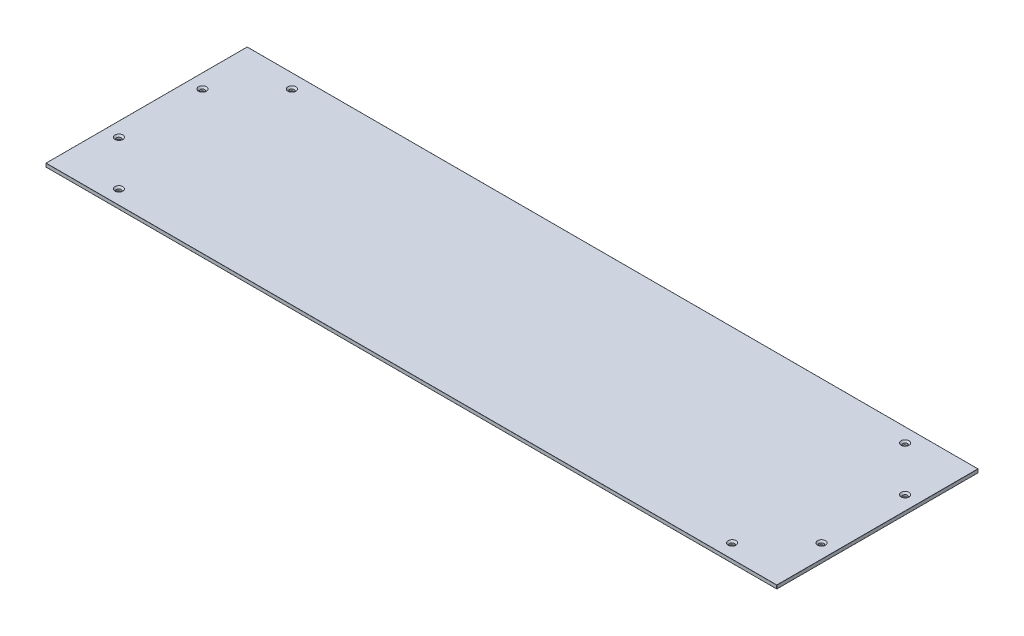
ISO-10303-21;
HEADER;
FILE_DESCRIPTION(('STEP AP214'),'2;1');
FILE_NAME('part.step','',(''),(''),'','','');
FILE_SCHEMA(('AUTOMOTIVE_DESIGN { 1 0 10303 214 1 1 1 1 }'));
ENDSEC;
DATA;
#1=APPLICATION_CONTEXT('core data for automotive mechanical design processes');
#2=APPLICATION_PROTOCOL_DEFINITION('international standard','automotive_design',2000,#1);
#3=PRODUCT_CONTEXT('',#1,'mechanical');
#4=PRODUCT('Part','Part','',(#3));
#5=PRODUCT_RELATED_PRODUCT_CATEGORY('part','',(#4));
#6=PRODUCT_DEFINITION_FORMATION('','',#4);
#7=PRODUCT_DEFINITION_CONTEXT('part definition',#1,'design');
#8=PRODUCT_DEFINITION('design','',#6,#7);
#9=PRODUCT_DEFINITION_SHAPE('','',#8);
#10=(LENGTH_UNIT() NAMED_UNIT(*) SI_UNIT(.MILLI.,.METRE.));
#11=(NAMED_UNIT(*) PLANE_ANGLE_UNIT() SI_UNIT($,.RADIAN.));
#12=(NAMED_UNIT(*) SI_UNIT($,.STERADIAN.) SOLID_ANGLE_UNIT());
#13=UNCERTAINTY_MEASURE_WITH_UNIT(LENGTH_MEASURE(1.E-05),#10,'distance_accuracy_value','');
#14=(GEOMETRIC_REPRESENTATION_CONTEXT(3) GLOBAL_UNCERTAINTY_ASSIGNED_CONTEXT((#13)) GLOBAL_UNIT_ASSIGNED_CONTEXT((#10,
#11,#12)) REPRESENTATION_CONTEXT('',''));
#15=CARTESIAN_POINT('',(0.,0.,0.));
#16=DIRECTION('',(0.,0.,1.));
#17=DIRECTION('',(1.,0.,0.));
#18=AXIS2_PLACEMENT_3D('',#15,#16,#17);
#19=CARTESIAN_POINT('',(621.,6.,-171.));
#20=DIRECTION('',(-1.,0.,0.));
#21=DIRECTION('',(0.,0.,1.));
#22=AXIS2_PLACEMENT_3D('',#19,#20,#21);
#23=PLANE('',#22);
#24=DIRECTION('',(0.,0.,-1.));
#25=VECTOR('',#24,1.);
#26=CARTESIAN_POINT('',(621.,0.2,-171.));
#27=LINE('',#26,#25);
#28=CARTESIAN_POINT('',(621.,0.2,170.8));
#29=VERTEX_POINT('',#28);
#30=CARTESIAN_POINT('',(621.,0.2,-170.8));
#31=VERTEX_POINT('',#30);
#32=EDGE_CURVE('E285',#29,#31,#27,.T.);
#33=ORIENTED_EDGE('',*,*,#32,.T.);
#34=DIRECTION('',(0.,-1.,0.));
#35=VECTOR('',#34,1.);
#36=CARTESIAN_POINT('',(621.,6.,-170.8));
#37=LINE('',#36,#35);
#38=CARTESIAN_POINT('',(621.,5.8,-170.8));
#39=VERTEX_POINT('',#38);
#40=EDGE_CURVE('E287',#31,#39,#37,.F.);
#41=ORIENTED_EDGE('',*,*,#40,.T.);
#42=DIRECTION('',(0.,0.,-1.));
#43=VECTOR('',#42,1.);
#44=CARTESIAN_POINT('',(621.,5.8,171.));
#45=LINE('',#44,#43);
#46=CARTESIAN_POINT('',(621.,5.8,170.8));
#47=VERTEX_POINT('',#46);
#48=EDGE_CURVE('E283',#39,#47,#45,.F.);
#49=ORIENTED_EDGE('',*,*,#48,.T.);
#50=DIRECTION('',(0.,-1.,0.));
#51=VECTOR('',#50,1.);
#52=CARTESIAN_POINT('',(621.,6.,170.8));
#53=LINE('',#52,#51);
#54=EDGE_CURVE('E281',#47,#29,#53,.T.);
#55=ORIENTED_EDGE('',*,*,#54,.T.);
#56=EDGE_LOOP('',(#33,#41,#49,#55));
#57=FACE_BOUND('',#56,.T.);
#58=ADVANCED_FACE('F32',(#57),#23,.F.);
#59=CARTESIAN_POINT('',(-621.,6.,-171.));
#60=DIRECTION('',(0.,0.,1.));
#61=DIRECTION('',(1.,0.,0.));
#62=AXIS2_PLACEMENT_3D('',#59,#60,#61);
#63=PLANE('',#62);
#64=DIRECTION('',(-1.,0.,0.));
#65=VECTOR('',#64,1.);
#66=CARTESIAN_POINT('',(621.,5.8,-171.));
#67=LINE('',#66,#65);
#68=CARTESIAN_POINT('',(-620.8,5.8,-171.));
#69=VERTEX_POINT('',#68);
#70=CARTESIAN_POINT('',(620.8,5.8,-171.));
#71=VERTEX_POINT('',#70);
#72=EDGE_CURVE('E131',#69,#71,#67,.F.);
#73=ORIENTED_EDGE('',*,*,#72,.T.);
#74=DIRECTION('',(0.,-1.,0.));
#75=VECTOR('',#74,1.);
#76=CARTESIAN_POINT('',(620.8,6.,-171.));
#77=LINE('',#76,#75);
#78=CARTESIAN_POINT('',(620.8,0.2,-171.));
#79=VERTEX_POINT('',#78);
#80=EDGE_CURVE('E127',#71,#79,#77,.T.);
#81=ORIENTED_EDGE('',*,*,#80,.T.);
#82=DIRECTION('',(-1.,0.,0.));
#83=VECTOR('',#82,1.);
#84=CARTESIAN_POINT('',(-621.,0.2,-171.));
#85=LINE('',#84,#83);
#86=CARTESIAN_POINT('',(-620.8,0.2,-171.));
#87=VERTEX_POINT('',#86);
#88=EDGE_CURVE('E121',#79,#87,#85,.T.);
#89=ORIENTED_EDGE('',*,*,#88,.T.);
#90=DIRECTION('',(0.,-1.,0.));
#91=VECTOR('',#90,1.);
#92=CARTESIAN_POINT('',(-620.8,6.,-171.));
#93=LINE('',#92,#91);
#94=EDGE_CURVE('E124',#87,#69,#93,.F.);
#95=ORIENTED_EDGE('',*,*,#94,.T.);
#96=EDGE_LOOP('',(#73,#81,#89,#95));
#97=FACE_BOUND('',#96,.T.);
#98=ADVANCED_FACE('F123',(#97),#63,.F.);
#99=CARTESIAN_POINT('',(-621.,6.,-171.));
#100=DIRECTION('',(1.,0.,0.));
#101=DIRECTION('',(0.,0.,-1.));
#102=AXIS2_PLACEMENT_3D('',#99,#100,#101);
#103=PLANE('',#102);
#104=DIRECTION('',(0.,0.,1.));
#105=VECTOR('',#104,1.);
#106=CARTESIAN_POINT('',(-621.,5.8,-171.));
#107=LINE('',#106,#105);
#108=CARTESIAN_POINT('',(-621.,5.8,170.8));
#109=VERTEX_POINT('',#108);
#110=CARTESIAN_POINT('',(-621.,5.8,-170.8));
#111=VERTEX_POINT('',#110);
#112=EDGE_CURVE('E308',#109,#111,#107,.F.);
#113=ORIENTED_EDGE('',*,*,#112,.T.);
#114=DIRECTION('',(0.,-1.,0.));
#115=VECTOR('',#114,1.);
#116=CARTESIAN_POINT('',(-621.,6.,-170.8));
#117=LINE('',#116,#115);
#118=CARTESIAN_POINT('',(-621.,0.2,-170.8));
#119=VERTEX_POINT('',#118);
#120=EDGE_CURVE('E312',#111,#119,#117,.T.);
#121=ORIENTED_EDGE('',*,*,#120,.T.);
#122=DIRECTION('',(0.,0.,1.));
#123=VECTOR('',#122,1.);
#124=CARTESIAN_POINT('',(-621.,0.2,-171.));
#125=LINE('',#124,#123);
#126=CARTESIAN_POINT('',(-621.,0.2,170.8));
#127=VERTEX_POINT('',#126);
#128=EDGE_CURVE('E310',#119,#127,#125,.T.);
#129=ORIENTED_EDGE('',*,*,#128,.T.);
#130=DIRECTION('',(0.,-1.,0.));
#131=VECTOR('',#130,1.);
#132=CARTESIAN_POINT('',(-621.,6.,170.8));
#133=LINE('',#132,#131);
#134=EDGE_CURVE('E306',#127,#109,#133,.F.);
#135=ORIENTED_EDGE('',*,*,#134,.T.);
#136=EDGE_LOOP('',(#113,#121,#129,#135));
#137=FACE_BOUND('',#136,.T.);
#138=ADVANCED_FACE('F363',(#137),#103,.F.);
#139=CARTESIAN_POINT('',(-621.,6.,171.));
#140=DIRECTION('',(0.,0.,-1.));
#141=DIRECTION('',(-1.,0.,0.));
#142=AXIS2_PLACEMENT_3D('',#139,#140,#141);
#143=PLANE('',#142);
#144=DIRECTION('',(0.,-1.,0.));
#145=VECTOR('',#144,1.);
#146=CARTESIAN_POINT('',(-620.8,6.,171.));
#147=LINE('',#146,#145);
#148=CARTESIAN_POINT('',(-620.8,5.8,171.));
#149=VERTEX_POINT('',#148);
#150=CARTESIAN_POINT('',(-620.8,0.2,171.));
#151=VERTEX_POINT('',#150);
#152=EDGE_CURVE('E52',#149,#151,#147,.T.);
#153=ORIENTED_EDGE('',*,*,#152,.T.);
#154=DIRECTION('',(1.,0.,0.));
#155=VECTOR('',#154,1.);
#156=CARTESIAN_POINT('',(-621.,0.2,171.));
#157=LINE('',#156,#155);
#158=CARTESIAN_POINT('',(620.8,0.2,171.));
#159=VERTEX_POINT('',#158);
#160=EDGE_CURVE('E11',#151,#159,#157,.T.);
#161=ORIENTED_EDGE('',*,*,#160,.T.);
#162=DIRECTION('',(0.,-1.,0.));
#163=VECTOR('',#162,1.);
#164=CARTESIAN_POINT('',(620.8,6.,171.));
#165=LINE('',#164,#163);
#166=CARTESIAN_POINT('',(620.8,5.8,171.));
#167=VERTEX_POINT('',#166);
#168=EDGE_CURVE('E41',#159,#167,#165,.F.);
#169=ORIENTED_EDGE('',*,*,#168,.T.);
#170=DIRECTION('',(1.,0.,0.));
#171=VECTOR('',#170,1.);
#172=CARTESIAN_POINT('',(-621.,5.8,171.));
#173=LINE('',#172,#171);
#174=EDGE_CURVE('E315',#167,#149,#173,.F.);
#175=ORIENTED_EDGE('',*,*,#174,.T.);
#176=EDGE_LOOP('',(#153,#161,#169,#175));
#177=FACE_BOUND('',#176,.T.);
#178=ADVANCED_FACE('F717',(#177),#143,.F.);
#179=CARTESIAN_POINT('',(0.,6.,0.));
#180=DIRECTION('',(0.,1.,0.));
#181=DIRECTION('',(0.,0.,1.));
#182=AXIS2_PLACEMENT_3D('',#179,#180,#181);
#183=PLANE('',#182);
#184=DIRECTION('',(0.,0.,-1.));
#185=VECTOR('',#184,1.);
#186=CARTESIAN_POINT('',(620.8,6.,-171.));
#187=LINE('',#186,#185);
#188=CARTESIAN_POINT('',(620.8,6.,170.8));
#189=VERTEX_POINT('',#188);
#190=CARTESIAN_POINT('',(620.8,6.,-170.8));
#191=VERTEX_POINT('',#190);
#192=EDGE_CURVE('E301',#189,#191,#187,.T.);
#193=ORIENTED_EDGE('',*,*,#192,.T.);
#194=DIRECTION('',(-1.,0.,0.));
#195=VECTOR('',#194,1.);
#196=CARTESIAN_POINT('',(-621.,6.,-170.8));
#197=LINE('',#196,#195);
#198=CARTESIAN_POINT('',(-620.8,6.,-170.8));
#199=VERTEX_POINT('',#198);
#200=EDGE_CURVE('E303',#191,#199,#197,.T.);
#201=ORIENTED_EDGE('',*,*,#200,.T.);
#202=DIRECTION('',(0.,0.,1.));
#203=VECTOR('',#202,1.);
#204=CARTESIAN_POINT('',(-620.8,6.,171.));
#205=LINE('',#204,#203);
#206=CARTESIAN_POINT('',(-620.8,6.,170.8));
#207=VERTEX_POINT('',#206);
#208=EDGE_CURVE('E299',#199,#207,#205,.T.);
#209=ORIENTED_EDGE('',*,*,#208,.T.);
#210=DIRECTION('',(1.,0.,0.));
#211=VECTOR('',#210,1.);
#212=CARTESIAN_POINT('',(621.,6.,170.8));
#213=LINE('',#212,#211);
#214=EDGE_CURVE('E297',#207,#189,#213,.T.);
#215=ORIENTED_EDGE('',*,*,#214,.T.);
#216=EDGE_LOOP('',(#193,#201,#209,#215));
#217=FACE_BOUND('',#216,.T.);
#218=CARTESIAN_POINT('',(-597.,6.,-71.));
#219=DIRECTION('',(0.,1.,0.));
#220=DIRECTION('',(0.,0.,1.));
#221=AXIS2_PLACEMENT_3D('',#218,#219,#220);
#222=CIRCLE('',#221,6.74999999999992);
#223=CARTESIAN_POINT('',(-597.,6.,-64.2500000000001));
#224=VERTEX_POINT('',#223);
#225=EDGE_CURVE('E256',#224,#224,#222,.F.);
#226=ORIENTED_EDGE('',*,*,#225,.T.);
#227=EDGE_LOOP('',(#226));
#228=FACE_BOUND('',#227,.T.);
#229=CARTESIAN_POINT('',(-521.,6.,-147.));
#230=DIRECTION('',(0.,1.,0.));
#231=DIRECTION('',(0.,0.,1.));
#232=AXIS2_PLACEMENT_3D('',#229,#230,#231);
#233=CIRCLE('',#232,6.74999999999992);
#234=CARTESIAN_POINT('',(-521.,6.,-140.25));
#235=VERTEX_POINT('',#234);
#236=EDGE_CURVE('E253',#235,#235,#233,.F.);
#237=ORIENTED_EDGE('',*,*,#236,.T.);
#238=EDGE_LOOP('',(#237));
#239=FACE_BOUND('',#238,.T.);
#240=CARTESIAN_POINT('',(521.,6.,-147.));
#241=DIRECTION('',(0.,1.,0.));
#242=DIRECTION('',(0.,0.,1.));
#243=AXIS2_PLACEMENT_3D('',#240,#241,#242);
#244=CIRCLE('',#243,6.74999999999992);
#245=CARTESIAN_POINT('',(521.,6.,-140.25));
#246=VERTEX_POINT('',#245);
#247=EDGE_CURVE('E250',#246,#246,#244,.F.);
#248=ORIENTED_EDGE('',*,*,#247,.T.);
#249=EDGE_LOOP('',(#248));
#250=FACE_BOUND('',#249,.T.);
#251=CARTESIAN_POINT('',(597.,6.,-71.0000000000002));
#252=DIRECTION('',(0.,1.,0.));
#253=DIRECTION('',(0.,0.,1.));
#254=AXIS2_PLACEMENT_3D('',#251,#252,#253);
#255=CIRCLE('',#254,6.74999999999992);
#256=CARTESIAN_POINT('',(597.,6.,-64.2500000000003));
#257=VERTEX_POINT('',#256);
#258=EDGE_CURVE('E247',#257,#257,#255,.F.);
#259=ORIENTED_EDGE('',*,*,#258,.T.);
#260=EDGE_LOOP('',(#259));
#261=FACE_BOUND('',#260,.T.);
#262=CARTESIAN_POINT('',(597.,6.,70.9999999999999));
#263=DIRECTION('',(0.,1.,0.));
#264=DIRECTION('',(0.,0.,1.));
#265=AXIS2_PLACEMENT_3D('',#262,#263,#264);
#266=CIRCLE('',#265,6.74999999999992);
#267=CARTESIAN_POINT('',(597.,6.,77.7499999999998));
#268=VERTEX_POINT('',#267);
#269=EDGE_CURVE('E244',#268,#268,#266,.F.);
#270=ORIENTED_EDGE('',*,*,#269,.T.);
#271=EDGE_LOOP('',(#270));
#272=FACE_BOUND('',#271,.T.);
#273=CARTESIAN_POINT('',(521.,6.,147.));
#274=DIRECTION('',(0.,1.,0.));
#275=DIRECTION('',(0.,0.,1.));
#276=AXIS2_PLACEMENT_3D('',#273,#274,#275);
#277=CIRCLE('',#276,6.74999999999992);
#278=CARTESIAN_POINT('',(521.,6.,153.75));
#279=VERTEX_POINT('',#278);
#280=EDGE_CURVE('E241',#279,#279,#277,.F.);
#281=ORIENTED_EDGE('',*,*,#280,.T.);
#282=EDGE_LOOP('',(#281));
#283=FACE_BOUND('',#282,.T.);
#284=CARTESIAN_POINT('',(-521.,6.,147.));
#285=DIRECTION('',(0.,1.,0.));
#286=DIRECTION('',(0.,0.,1.));
#287=AXIS2_PLACEMENT_3D('',#284,#285,#286);
#288=CIRCLE('',#287,6.74999999999992);
#289=CARTESIAN_POINT('',(-521.,6.,153.75));
#290=VERTEX_POINT('',#289);
#291=EDGE_CURVE('E238',#290,#290,#288,.F.);
#292=ORIENTED_EDGE('',*,*,#291,.T.);
#293=EDGE_LOOP('',(#292));
#294=FACE_BOUND('',#293,.T.);
#295=CARTESIAN_POINT('',(-597.,6.,71.));
#296=DIRECTION('',(0.,1.,0.));
#297=DIRECTION('',(0.,0.,1.));
#298=AXIS2_PLACEMENT_3D('',#295,#296,#297);
#299=CIRCLE('',#298,6.74999999999992);
#300=CARTESIAN_POINT('',(-597.,6.,77.75));
#301=VERTEX_POINT('',#300);
#302=EDGE_CURVE('E235',#301,#301,#299,.F.);
#303=ORIENTED_EDGE('',*,*,#302,.T.);
#304=EDGE_LOOP('',(#303));
#305=FACE_BOUND('',#304,.T.);
#306=ADVANCED_FACE('F376',(#217,#228,#239,#250,#261,#272,#283,#294,#305),#183,.T.);
#307=CARTESIAN_POINT('',(0.,0.,0.));
#308=DIRECTION('',(0.,1.,0.));
#309=DIRECTION('',(0.,0.,1.));
#310=AXIS2_PLACEMENT_3D('',#307,#308,#309);
#311=PLANE('',#310);
#312=DIRECTION('',(0.,0.,1.));
#313=VECTOR('',#312,1.);
#314=CARTESIAN_POINT('',(-620.8,0.,0.));
#315=LINE('',#314,#313);
#316=CARTESIAN_POINT('',(-620.8,0.,170.8));
#317=VERTEX_POINT('',#316);
#318=CARTESIAN_POINT('',(-620.8,0.,-170.8));
#319=VERTEX_POINT('',#318);
#320=EDGE_CURVE('E292',#317,#319,#315,.F.);
#321=ORIENTED_EDGE('',*,*,#320,.T.);
#322=DIRECTION('',(-1.,0.,0.));
#323=VECTOR('',#322,1.);
#324=CARTESIAN_POINT('',(0.,0.,-170.8));
#325=LINE('',#324,#323);
#326=CARTESIAN_POINT('',(620.8,0.,-170.8));
#327=VERTEX_POINT('',#326);
#328=EDGE_CURVE('E155',#319,#327,#325,.F.);
#329=ORIENTED_EDGE('',*,*,#328,.T.);
#330=DIRECTION('',(0.,0.,-1.));
#331=VECTOR('',#330,1.);
#332=CARTESIAN_POINT('',(620.8,0.,-4.03056405665086E-13));
#333=LINE('',#332,#331);
#334=CARTESIAN_POINT('',(620.8,0.,170.8));
#335=VERTEX_POINT('',#334);
#336=EDGE_CURVE('E294',#327,#335,#333,.F.);
#337=ORIENTED_EDGE('',*,*,#336,.T.);
#338=DIRECTION('',(1.,0.,0.));
#339=VECTOR('',#338,1.);
#340=CARTESIAN_POINT('',(0.,0.,170.8));
#341=LINE('',#340,#339);
#342=EDGE_CURVE('E290',#335,#317,#341,.F.);
#343=ORIENTED_EDGE('',*,*,#342,.T.);
#344=EDGE_LOOP('',(#321,#329,#337,#343));
#345=FACE_BOUND('',#344,.T.);
#346=CARTESIAN_POINT('',(-597.,0.,-71.));
#347=DIRECTION('',(0.,1.,0.));
#348=DIRECTION('',(0.,0.,-1.));
#349=AXIS2_PLACEMENT_3D('',#346,#347,#348);
#350=CIRCLE('',#349,3.99999999999999);
#351=CARTESIAN_POINT('',(-597.,0.,-75.));
#352=VERTEX_POINT('',#351);
#353=EDGE_CURVE('E201',#352,#352,#350,.T.);
#354=ORIENTED_EDGE('',*,*,#353,.T.);
#355=EDGE_LOOP('',(#354));
#356=FACE_BOUND('',#355,.T.);
#357=CARTESIAN_POINT('',(-521.,0.,-147.));
#358=DIRECTION('',(0.,1.,0.));
#359=DIRECTION('',(0.,0.,-1.));
#360=AXIS2_PLACEMENT_3D('',#357,#358,#359);
#361=CIRCLE('',#360,3.99999999999999);
#362=CARTESIAN_POINT('',(-521.,0.,-151.));
#363=VERTEX_POINT('',#362);
#364=EDGE_CURVE('E207',#363,#363,#361,.T.);
#365=ORIENTED_EDGE('',*,*,#364,.T.);
#366=EDGE_LOOP('',(#365));
#367=FACE_BOUND('',#366,.T.);
#368=CARTESIAN_POINT('',(521.,0.,-147.));
#369=DIRECTION('',(0.,1.,0.));
#370=DIRECTION('',(0.,0.,1.));
#371=AXIS2_PLACEMENT_3D('',#368,#369,#370);
#372=CIRCLE('',#371,3.99999999999999);
#373=CARTESIAN_POINT('',(521.,0.,-143.));
#374=VERTEX_POINT('',#373);
#375=EDGE_CURVE('E212',#374,#374,#372,.T.);
#376=ORIENTED_EDGE('',*,*,#375,.T.);
#377=EDGE_LOOP('',(#376));
#378=FACE_BOUND('',#377,.T.);
#379=CARTESIAN_POINT('',(597.,0.,-71.0000000000002));
#380=DIRECTION('',(0.,1.,0.));
#381=DIRECTION('',(0.,0.,1.));
#382=AXIS2_PLACEMENT_3D('',#379,#380,#381);
#383=CIRCLE('',#382,3.99999999999999);
#384=CARTESIAN_POINT('',(597.,0.,-67.0000000000002));
#385=VERTEX_POINT('',#384);
#386=EDGE_CURVE('E217',#385,#385,#383,.T.);
#387=ORIENTED_EDGE('',*,*,#386,.T.);
#388=EDGE_LOOP('',(#387));
#389=FACE_BOUND('',#388,.T.);
#390=CARTESIAN_POINT('',(597.,0.,70.9999999999999));
#391=DIRECTION('',(0.,1.,0.));
#392=DIRECTION('',(0.,0.,-1.));
#393=AXIS2_PLACEMENT_3D('',#390,#391,#392);
#394=CIRCLE('',#393,3.99999999999999);
#395=CARTESIAN_POINT('',(597.,0.,66.9999999999999));
#396=VERTEX_POINT('',#395);
#397=EDGE_CURVE('E220',#396,#396,#394,.T.);
#398=ORIENTED_EDGE('',*,*,#397,.T.);
#399=EDGE_LOOP('',(#398));
#400=FACE_BOUND('',#399,.T.);
#401=CARTESIAN_POINT('',(-597.,0.,71.));
#402=DIRECTION('',(0.,1.,0.));
#403=DIRECTION('',(0.,0.,1.));
#404=AXIS2_PLACEMENT_3D('',#401,#402,#403);
#405=CIRCLE('',#404,3.99999999999999);
#406=CARTESIAN_POINT('',(-597.,0.,75.));
#407=VERTEX_POINT('',#406);
#408=EDGE_CURVE('E223',#407,#407,#405,.T.);
#409=ORIENTED_EDGE('',*,*,#408,.T.);
#410=EDGE_LOOP('',(#409));
#411=FACE_BOUND('',#410,.T.);
#412=CARTESIAN_POINT('',(521.,0.,147.));
#413=DIRECTION('',(0.,1.,0.));
#414=DIRECTION('',(0.,0.,-1.));
#415=AXIS2_PLACEMENT_3D('',#412,#413,#414);
#416=CIRCLE('',#415,3.99999999999999);
#417=CARTESIAN_POINT('',(521.,0.,143.));
#418=VERTEX_POINT('',#417);
#419=EDGE_CURVE('E226',#418,#418,#416,.T.);
#420=ORIENTED_EDGE('',*,*,#419,.T.);
#421=EDGE_LOOP('',(#420));
#422=FACE_BOUND('',#421,.T.);
#423=CARTESIAN_POINT('',(-521.,0.,147.));
#424=DIRECTION('',(0.,1.,0.));
#425=DIRECTION('',(0.,0.,1.));
#426=AXIS2_PLACEMENT_3D('',#423,#424,#425);
#427=CIRCLE('',#426,3.99999999999999);
#428=CARTESIAN_POINT('',(-521.,0.,151.));
#429=VERTEX_POINT('',#428);
#430=EDGE_CURVE('E229',#429,#429,#427,.T.);
#431=ORIENTED_EDGE('',*,*,#430,.T.);
#432=EDGE_LOOP('',(#431));
#433=FACE_BOUND('',#432,.T.);
#434=ADVANCED_FACE('F357',(#345,#356,#367,#378,#389,#400,#411,#422,#433),#311,.F.);
#435=CARTESIAN_POINT('',(-521.,0.,147.));
#436=DIRECTION('',(0.,1.,0.));
#437=DIRECTION('',(0.,0.,1.));
#438=AXIS2_PLACEMENT_3D('',#435,#436,#437);
#439=CYLINDRICAL_SURFACE('',#438,3.99999999999999);
#440=CARTESIAN_POINT('',(-521.,3.25000000000017,147.));
#441=DIRECTION('',(0.,1.,0.));
#442=DIRECTION('',(0.,0.,1.));
#443=AXIS2_PLACEMENT_3D('',#440,#441,#442);
#444=CIRCLE('',#443,3.99999999999999);
#445=CARTESIAN_POINT('',(-521.,3.25000000000017,151.));
#446=VERTEX_POINT('',#445);
#447=EDGE_CURVE('E274',#446,#446,#444,.T.);
#448=ORIENTED_EDGE('',*,*,#447,.T.);
#449=EDGE_LOOP('',(#448));
#450=FACE_BOUND('',#449,.T.);
#451=ORIENTED_EDGE('',*,*,#430,.F.);
#452=EDGE_LOOP('',(#451));
#453=FACE_BOUND('',#452,.T.);
#454=ADVANCED_FACE('F694',(#450,#453),#439,.F.);
#455=CARTESIAN_POINT('',(521.,0.,147.));
#456=DIRECTION('',(0.,1.,0.));
#457=DIRECTION('',(0.,0.,1.));
#458=AXIS2_PLACEMENT_3D('',#455,#456,#457);
#459=CYLINDRICAL_SURFACE('',#458,3.99999999999999);
#460=CARTESIAN_POINT('',(521.,3.25000000000017,147.));
#461=DIRECTION('',(0.,1.,0.));
#462=DIRECTION('',(0.,0.,1.));
#463=AXIS2_PLACEMENT_3D('',#460,#461,#462);
#464=CIRCLE('',#463,3.99999999999999);
#465=CARTESIAN_POINT('',(521.,3.25000000000017,151.));
#466=VERTEX_POINT('',#465);
#467=EDGE_CURVE('E271',#466,#466,#464,.T.);
#468=ORIENTED_EDGE('',*,*,#467,.T.);
#469=EDGE_LOOP('',(#468));
#470=FACE_BOUND('',#469,.T.);
#471=ORIENTED_EDGE('',*,*,#419,.F.);
#472=EDGE_LOOP('',(#471));
#473=FACE_BOUND('',#472,.T.);
#474=ADVANCED_FACE('F685',(#470,#473),#459,.F.);
#475=CARTESIAN_POINT('',(-597.,0.,71.));
#476=DIRECTION('',(0.,1.,0.));
#477=DIRECTION('',(0.,0.,1.));
#478=AXIS2_PLACEMENT_3D('',#475,#476,#477);
#479=CYLINDRICAL_SURFACE('',#478,3.99999999999999);
#480=CARTESIAN_POINT('',(-597.,3.25000000000017,71.));
#481=DIRECTION('',(0.,1.,0.));
#482=DIRECTION('',(0.,0.,1.));
#483=AXIS2_PLACEMENT_3D('',#480,#481,#482);
#484=CIRCLE('',#483,3.99999999999999);
#485=CARTESIAN_POINT('',(-597.,3.25000000000017,75.));
#486=VERTEX_POINT('',#485);
#487=EDGE_CURVE('E143',#486,#486,#484,.T.);
#488=ORIENTED_EDGE('',*,*,#487,.T.);
#489=EDGE_LOOP('',(#488));
#490=FACE_BOUND('',#489,.T.);
#491=ORIENTED_EDGE('',*,*,#408,.F.);
#492=EDGE_LOOP('',(#491));
#493=FACE_BOUND('',#492,.T.);
#494=ADVANCED_FACE('F676',(#490,#493),#479,.F.);
#495=CARTESIAN_POINT('',(597.,0.,70.9999999999999));
#496=DIRECTION('',(0.,1.,0.));
#497=DIRECTION('',(0.,0.,1.));
#498=AXIS2_PLACEMENT_3D('',#495,#496,#497);
#499=CYLINDRICAL_SURFACE('',#498,3.99999999999999);
#500=CARTESIAN_POINT('',(597.,3.25000000000017,70.9999999999999));
#501=DIRECTION('',(0.,1.,0.));
#502=DIRECTION('',(0.,0.,1.));
#503=AXIS2_PLACEMENT_3D('',#500,#501,#502);
#504=CIRCLE('',#503,3.99999999999999);
#505=CARTESIAN_POINT('',(597.,3.25000000000017,74.9999999999999));
#506=VERTEX_POINT('',#505);
#507=EDGE_CURVE('E268',#506,#506,#504,.T.);
#508=ORIENTED_EDGE('',*,*,#507,.T.);
#509=EDGE_LOOP('',(#508));
#510=FACE_BOUND('',#509,.T.);
#511=ORIENTED_EDGE('',*,*,#397,.F.);
#512=EDGE_LOOP('',(#511));
#513=FACE_BOUND('',#512,.T.);
#514=ADVANCED_FACE('F667',(#510,#513),#499,.F.);
#515=CARTESIAN_POINT('',(597.,0.,-71.0000000000002));
#516=DIRECTION('',(0.,1.,0.));
#517=DIRECTION('',(0.,0.,1.));
#518=AXIS2_PLACEMENT_3D('',#515,#516,#517);
#519=CYLINDRICAL_SURFACE('',#518,3.99999999999999);
#520=CARTESIAN_POINT('',(597.,3.25000000000017,-71.0000000000002));
#521=DIRECTION('',(0.,1.,0.));
#522=DIRECTION('',(0.,0.,1.));
#523=AXIS2_PLACEMENT_3D('',#520,#521,#522);
#524=CIRCLE('',#523,3.99999999999999);
#525=CARTESIAN_POINT('',(597.,3.25000000000017,-67.0000000000002));
#526=VERTEX_POINT('',#525);
#527=EDGE_CURVE('E265',#526,#526,#524,.T.);
#528=ORIENTED_EDGE('',*,*,#527,.T.);
#529=EDGE_LOOP('',(#528));
#530=FACE_BOUND('',#529,.T.);
#531=ORIENTED_EDGE('',*,*,#386,.F.);
#532=EDGE_LOOP('',(#531));
#533=FACE_BOUND('',#532,.T.);
#534=ADVANCED_FACE('F658',(#530,#533),#519,.F.);
#535=CARTESIAN_POINT('',(521.,0.,-147.));
#536=DIRECTION('',(0.,1.,0.));
#537=DIRECTION('',(0.,0.,1.));
#538=AXIS2_PLACEMENT_3D('',#535,#536,#537);
#539=CYLINDRICAL_SURFACE('',#538,3.99999999999999);
#540=CARTESIAN_POINT('',(521.,3.25000000000017,-147.));
#541=DIRECTION('',(0.,1.,0.));
#542=DIRECTION('',(0.,0.,1.));
#543=AXIS2_PLACEMENT_3D('',#540,#541,#542);
#544=CIRCLE('',#543,3.99999999999999);
#545=CARTESIAN_POINT('',(521.,3.25000000000017,-143.));
#546=VERTEX_POINT('',#545);
#547=EDGE_CURVE('E262',#546,#546,#544,.T.);
#548=ORIENTED_EDGE('',*,*,#547,.T.);
#549=EDGE_LOOP('',(#548));
#550=FACE_BOUND('',#549,.T.);
#551=ORIENTED_EDGE('',*,*,#375,.F.);
#552=EDGE_LOOP('',(#551));
#553=FACE_BOUND('',#552,.T.);
#554=ADVANCED_FACE('F649',(#550,#553),#539,.F.);
#555=CARTESIAN_POINT('',(-521.,0.,-147.));
#556=DIRECTION('',(0.,1.,0.));
#557=DIRECTION('',(0.,0.,1.));
#558=AXIS2_PLACEMENT_3D('',#555,#556,#557);
#559=CYLINDRICAL_SURFACE('',#558,3.99999999999999);
#560=CARTESIAN_POINT('',(-521.,3.25000000000017,-147.));
#561=DIRECTION('',(0.,1.,0.));
#562=DIRECTION('',(0.,0.,1.));
#563=AXIS2_PLACEMENT_3D('',#560,#561,#562);
#564=CIRCLE('',#563,3.99999999999999);
#565=CARTESIAN_POINT('',(-521.,3.25000000000017,-143.));
#566=VERTEX_POINT('',#565);
#567=EDGE_CURVE('E259',#566,#566,#564,.T.);
#568=ORIENTED_EDGE('',*,*,#567,.T.);
#569=EDGE_LOOP('',(#568));
#570=FACE_BOUND('',#569,.T.);
#571=ORIENTED_EDGE('',*,*,#364,.F.);
#572=EDGE_LOOP('',(#571));
#573=FACE_BOUND('',#572,.T.);
#574=ADVANCED_FACE('F640',(#570,#573),#559,.F.);
#575=CARTESIAN_POINT('',(-597.,0.,-71.));
#576=DIRECTION('',(0.,1.,0.));
#577=DIRECTION('',(0.,0.,1.));
#578=AXIS2_PLACEMENT_3D('',#575,#576,#577);
#579=CYLINDRICAL_SURFACE('',#578,3.99999999999999);
#580=CARTESIAN_POINT('',(-597.,3.25000000000017,-71.));
#581=DIRECTION('',(0.,1.,0.));
#582=DIRECTION('',(0.,0.,1.));
#583=AXIS2_PLACEMENT_3D('',#580,#581,#582);
#584=CIRCLE('',#583,3.99999999999999);
#585=CARTESIAN_POINT('',(-597.,3.25000000000017,-67.));
#586=VERTEX_POINT('',#585);
#587=EDGE_CURVE('E232',#586,#586,#584,.T.);
#588=ORIENTED_EDGE('',*,*,#587,.T.);
#589=EDGE_LOOP('',(#588));
#590=FACE_BOUND('',#589,.T.);
#591=ORIENTED_EDGE('',*,*,#353,.F.);
#592=EDGE_LOOP('',(#591));
#593=FACE_BOUND('',#592,.T.);
#594=ADVANCED_FACE('F415',(#590,#593),#579,.F.);
#595=CARTESIAN_POINT('',(-597.,3.25000000000017,-71.));
#596=DIRECTION('',(0.,1.,0.));
#597=DIRECTION('',(0.,0.,1.));
#598=AXIS2_PLACEMENT_3D('',#595,#596,#597);
#599=CONICAL_SURFACE('',#598,3.99999999999999,0.785398163397466);
#600=ORIENTED_EDGE('',*,*,#225,.F.);
#601=EDGE_LOOP('',(#600));
#602=FACE_BOUND('',#601,.T.);
#603=ORIENTED_EDGE('',*,*,#587,.F.);
#604=EDGE_LOOP('',(#603));
#605=FACE_BOUND('',#604,.T.);
#606=ADVANCED_FACE('F411',(#602,#605),#599,.F.);
#607=CARTESIAN_POINT('',(-521.,3.25000000000017,-147.));
#608=DIRECTION('',(0.,1.,0.));
#609=DIRECTION('',(0.,0.,1.));
#610=AXIS2_PLACEMENT_3D('',#607,#608,#609);
#611=CONICAL_SURFACE('',#610,3.99999999999999,0.785398163397466);
#612=ORIENTED_EDGE('',*,*,#236,.F.);
#613=EDGE_LOOP('',(#612));
#614=FACE_BOUND('',#613,.T.);
#615=ORIENTED_EDGE('',*,*,#567,.F.);
#616=EDGE_LOOP('',(#615));
#617=FACE_BOUND('',#616,.T.);
#618=ADVANCED_FACE('F414',(#614,#617),#611,.F.);
#619=CARTESIAN_POINT('',(521.,3.25000000000017,-147.));
#620=DIRECTION('',(0.,1.,0.));
#621=DIRECTION('',(0.,0.,1.));
#622=AXIS2_PLACEMENT_3D('',#619,#620,#621);
#623=CONICAL_SURFACE('',#622,3.99999999999999,0.785398163397466);
#624=ORIENTED_EDGE('',*,*,#247,.F.);
#625=EDGE_LOOP('',(#624));
#626=FACE_BOUND('',#625,.T.);
#627=ORIENTED_EDGE('',*,*,#547,.F.);
#628=EDGE_LOOP('',(#627));
#629=FACE_BOUND('',#628,.T.);
#630=ADVANCED_FACE('F419',(#626,#629),#623,.F.);
#631=CARTESIAN_POINT('',(597.,3.25000000000017,-71.0000000000002));
#632=DIRECTION('',(0.,1.,0.));
#633=DIRECTION('',(0.,0.,1.));
#634=AXIS2_PLACEMENT_3D('',#631,#632,#633);
#635=CONICAL_SURFACE('',#634,3.99999999999999,0.785398163397466);
#636=ORIENTED_EDGE('',*,*,#258,.F.);
#637=EDGE_LOOP('',(#636));
#638=FACE_BOUND('',#637,.T.);
#639=ORIENTED_EDGE('',*,*,#527,.F.);
#640=EDGE_LOOP('',(#639));
#641=FACE_BOUND('',#640,.T.);
#642=ADVANCED_FACE('F423',(#638,#641),#635,.F.);
#643=CARTESIAN_POINT('',(597.,3.25000000000017,70.9999999999999));
#644=DIRECTION('',(0.,1.,0.));
#645=DIRECTION('',(0.,0.,1.));
#646=AXIS2_PLACEMENT_3D('',#643,#644,#645);
#647=CONICAL_SURFACE('',#646,3.99999999999999,0.785398163397466);
#648=ORIENTED_EDGE('',*,*,#269,.F.);
#649=EDGE_LOOP('',(#648));
#650=FACE_BOUND('',#649,.T.);
#651=ORIENTED_EDGE('',*,*,#507,.F.);
#652=EDGE_LOOP('',(#651));
#653=FACE_BOUND('',#652,.T.);
#654=ADVANCED_FACE('F427',(#650,#653),#647,.F.);
#655=CARTESIAN_POINT('',(521.,3.25000000000017,147.));
#656=DIRECTION('',(0.,1.,0.));
#657=DIRECTION('',(0.,0.,1.));
#658=AXIS2_PLACEMENT_3D('',#655,#656,#657);
#659=CONICAL_SURFACE('',#658,3.99999999999999,0.785398163397466);
#660=ORIENTED_EDGE('',*,*,#280,.F.);
#661=EDGE_LOOP('',(#660));
#662=FACE_BOUND('',#661,.T.);
#663=ORIENTED_EDGE('',*,*,#467,.F.);
#664=EDGE_LOOP('',(#663));
#665=FACE_BOUND('',#664,.T.);
#666=ADVANCED_FACE('F431',(#662,#665),#659,.F.);
#667=CARTESIAN_POINT('',(-521.,3.25000000000017,147.));
#668=DIRECTION('',(0.,1.,0.));
#669=DIRECTION('',(0.,0.,1.));
#670=AXIS2_PLACEMENT_3D('',#667,#668,#669);
#671=CONICAL_SURFACE('',#670,3.99999999999999,0.785398163397466);
#672=ORIENTED_EDGE('',*,*,#291,.F.);
#673=EDGE_LOOP('',(#672));
#674=FACE_BOUND('',#673,.T.);
#675=ORIENTED_EDGE('',*,*,#447,.F.);
#676=EDGE_LOOP('',(#675));
#677=FACE_BOUND('',#676,.T.);
#678=ADVANCED_FACE('F435',(#674,#677),#671,.F.);
#679=CARTESIAN_POINT('',(-597.,3.25000000000017,71.));
#680=DIRECTION('',(0.,1.,0.));
#681=DIRECTION('',(0.,0.,1.));
#682=AXIS2_PLACEMENT_3D('',#679,#680,#681);
#683=CONICAL_SURFACE('',#682,3.99999999999999,0.785398163397466);
#684=ORIENTED_EDGE('',*,*,#302,.F.);
#685=EDGE_LOOP('',(#684));
#686=FACE_BOUND('',#685,.T.);
#687=ORIENTED_EDGE('',*,*,#487,.F.);
#688=EDGE_LOOP('',(#687));
#689=FACE_BOUND('',#688,.T.);
#690=ADVANCED_FACE('F439',(#686,#689),#683,.F.);
#691=CARTESIAN_POINT('',(-620.8,6.,170.8));
#692=DIRECTION('',(0.,-1.,0.));
#693=DIRECTION('',(0.,0.,-1.));
#694=AXIS2_PLACEMENT_3D('',#691,#692,#693);
#695=CYLINDRICAL_SURFACE('',#694,0.2);
#696=CARTESIAN_POINT('',(-620.8,5.8,170.8));
#697=DIRECTION('',(0.,1.,0.));
#698=DIRECTION('',(0.,0.,1.));
#699=AXIS2_PLACEMENT_3D('',#696,#697,#698);
#700=CIRCLE('',#699,0.2);
#701=EDGE_CURVE('E36',#109,#149,#700,.T.);
#702=ORIENTED_EDGE('',*,*,#701,.F.);
#703=ORIENTED_EDGE('',*,*,#134,.F.);
#704=CARTESIAN_POINT('',(-620.8,0.2,170.8));
#705=DIRECTION('',(0.,-1.,0.));
#706=DIRECTION('',(0.,0.,-1.));
#707=AXIS2_PLACEMENT_3D('',#704,#705,#706);
#708=CIRCLE('',#707,0.2);
#709=EDGE_CURVE('E195',#151,#127,#708,.T.);
#710=ORIENTED_EDGE('',*,*,#709,.F.);
#711=ORIENTED_EDGE('',*,*,#152,.F.);
#712=EDGE_LOOP('',(#702,#703,#710,#711));
#713=FACE_BOUND('',#712,.T.);
#714=ADVANCED_FACE('F34',(#713),#695,.T.);
#715=CARTESIAN_POINT('',(-620.8,5.8,170.8));
#716=DIRECTION('',(0.,0.,1.));
#717=DIRECTION('',(1.,0.,0.));
#718=AXIS2_PLACEMENT_3D('',#715,#716,#717);
#719=SPHERICAL_SURFACE('',#718,0.2);
#720=CARTESIAN_POINT('',(-620.8,5.8,170.8));
#721=DIRECTION('',(0.,0.,1.));
#722=DIRECTION('',(1.,0.,0.));
#723=AXIS2_PLACEMENT_3D('',#720,#721,#722);
#724=CIRCLE('',#723,0.2);
#725=EDGE_CURVE('E190',#109,#207,#724,.F.);
#726=ORIENTED_EDGE('',*,*,#725,.F.);
#727=ORIENTED_EDGE('',*,*,#701,.T.);
#728=CARTESIAN_POINT('',(-620.8,5.8,170.8));
#729=DIRECTION('',(-1.,0.,0.));
#730=DIRECTION('',(0.,0.,1.));
#731=AXIS2_PLACEMENT_3D('',#728,#729,#730);
#732=CIRCLE('',#731,0.2);
#733=EDGE_CURVE('E193',#207,#149,#732,.F.);
#734=ORIENTED_EDGE('',*,*,#733,.F.);
#735=EDGE_LOOP('',(#726,#727,#734));
#736=FACE_BOUND('',#735,.T.);
#737=ADVANCED_FACE('F396',(#736),#719,.T.);
#738=CARTESIAN_POINT('',(-620.8,0.2,170.8));
#739=DIRECTION('',(0.,0.,1.));
#740=DIRECTION('',(1.,0.,0.));
#741=AXIS2_PLACEMENT_3D('',#738,#739,#740);
#742=SPHERICAL_SURFACE('',#741,0.2);
#743=CARTESIAN_POINT('',(-620.8,0.2,170.8));
#744=DIRECTION('',(-1.,0.,0.));
#745=DIRECTION('',(0.,0.,1.));
#746=AXIS2_PLACEMENT_3D('',#743,#744,#745);
#747=CIRCLE('',#746,0.2);
#748=EDGE_CURVE('E184',#151,#317,#747,.F.);
#749=ORIENTED_EDGE('',*,*,#748,.F.);
#750=ORIENTED_EDGE('',*,*,#709,.T.);
#751=CARTESIAN_POINT('',(-620.8,0.2,170.8));
#752=DIRECTION('',(0.,0.,1.));
#753=DIRECTION('',(1.,0.,0.));
#754=AXIS2_PLACEMENT_3D('',#751,#752,#753);
#755=CIRCLE('',#754,0.2);
#756=EDGE_CURVE('E187',#317,#127,#755,.F.);
#757=ORIENTED_EDGE('',*,*,#756,.F.);
#758=EDGE_LOOP('',(#749,#750,#757));
#759=FACE_BOUND('',#758,.T.);
#760=ADVANCED_FACE('F394',(#759),#742,.T.);
#761=CARTESIAN_POINT('',(0.,5.8,170.8));
#762=DIRECTION('',(-1.,0.,0.));
#763=DIRECTION('',(0.,0.,1.));
#764=AXIS2_PLACEMENT_3D('',#761,#762,#763);
#765=CYLINDRICAL_SURFACE('',#764,0.2);
#766=ORIENTED_EDGE('',*,*,#733,.T.);
#767=ORIENTED_EDGE('',*,*,#174,.F.);
#768=CARTESIAN_POINT('',(620.8,5.8,170.8));
#769=DIRECTION('',(1.,0.,0.));
#770=DIRECTION('',(0.,0.,-1.));
#771=AXIS2_PLACEMENT_3D('',#768,#769,#770);
#772=CIRCLE('',#771,0.2);
#773=EDGE_CURVE('E179',#189,#167,#772,.T.);
#774=ORIENTED_EDGE('',*,*,#773,.F.);
#775=ORIENTED_EDGE('',*,*,#214,.F.);
#776=EDGE_LOOP('',(#766,#767,#774,#775));
#777=FACE_BOUND('',#776,.T.);
#778=ADVANCED_FACE('F382',(#777),#765,.T.);
#779=CARTESIAN_POINT('',(-620.8,5.8,0.));
#780=DIRECTION('',(0.,0.,-1.));
#781=DIRECTION('',(-1.,0.,0.));
#782=AXIS2_PLACEMENT_3D('',#779,#780,#781);
#783=CYLINDRICAL_SURFACE('',#782,0.2);
#784=ORIENTED_EDGE('',*,*,#725,.T.);
#785=ORIENTED_EDGE('',*,*,#208,.F.);
#786=CARTESIAN_POINT('',(-620.8,5.8,-170.8));
#787=DIRECTION('',(0.,0.,-1.));
#788=DIRECTION('',(-1.,0.,0.));
#789=AXIS2_PLACEMENT_3D('',#786,#787,#788);
#790=CIRCLE('',#789,0.2);
#791=EDGE_CURVE('E176',#111,#199,#790,.T.);
#792=ORIENTED_EDGE('',*,*,#791,.F.);
#793=ORIENTED_EDGE('',*,*,#112,.F.);
#794=EDGE_LOOP('',(#784,#785,#792,#793));
#795=FACE_BOUND('',#794,.T.);
#796=ADVANCED_FACE('F368',(#795),#783,.T.);
#797=CARTESIAN_POINT('',(-620.8,6.,-170.8));
#798=DIRECTION('',(0.,-1.,0.));
#799=DIRECTION('',(0.,0.,-1.));
#800=AXIS2_PLACEMENT_3D('',#797,#798,#799);
#801=CYLINDRICAL_SURFACE('',#800,0.2);
#802=CARTESIAN_POINT('',(-620.8,0.2,-170.8));
#803=DIRECTION('',(0.,-1.,0.));
#804=DIRECTION('',(0.,0.,-1.));
#805=AXIS2_PLACEMENT_3D('',#802,#803,#804);
#806=CIRCLE('',#805,0.2);
#807=EDGE_CURVE('E138',#119,#87,#806,.T.);
#808=ORIENTED_EDGE('',*,*,#807,.F.);
#809=ORIENTED_EDGE('',*,*,#120,.F.);
#810=CARTESIAN_POINT('',(-620.8,5.8,-170.8));
#811=DIRECTION('',(0.,1.,0.));
#812=DIRECTION('',(0.,0.,1.));
#813=AXIS2_PLACEMENT_3D('',#810,#811,#812);
#814=CIRCLE('',#813,0.2);
#815=EDGE_CURVE('E141',#69,#111,#814,.T.);
#816=ORIENTED_EDGE('',*,*,#815,.F.);
#817=ORIENTED_EDGE('',*,*,#94,.F.);
#818=EDGE_LOOP('',(#808,#809,#816,#817));
#819=FACE_BOUND('',#818,.T.);
#820=ADVANCED_FACE('F136',(#819),#801,.T.);
#821=CARTESIAN_POINT('',(-620.8,0.2,-171.));
#822=DIRECTION('',(0.,0.,1.));
#823=DIRECTION('',(1.,0.,0.));
#824=AXIS2_PLACEMENT_3D('',#821,#822,#823);
#825=CYLINDRICAL_SURFACE('',#824,0.2);
#826=ORIENTED_EDGE('',*,*,#756,.T.);
#827=ORIENTED_EDGE('',*,*,#128,.F.);
#828=CARTESIAN_POINT('',(-620.8,0.2,-170.8));
#829=DIRECTION('',(0.,0.,-1.));
#830=DIRECTION('',(-1.,0.,0.));
#831=AXIS2_PLACEMENT_3D('',#828,#829,#830);
#832=CIRCLE('',#831,0.2);
#833=EDGE_CURVE('E151',#319,#119,#832,.T.);
#834=ORIENTED_EDGE('',*,*,#833,.F.);
#835=ORIENTED_EDGE('',*,*,#320,.F.);
#836=EDGE_LOOP('',(#826,#827,#834,#835));
#837=FACE_BOUND('',#836,.T.);
#838=ADVANCED_FACE('F360',(#837),#825,.T.);
#839=CARTESIAN_POINT('',(-621.,0.2,170.8));
#840=DIRECTION('',(1.,0.,0.));
#841=DIRECTION('',(0.,0.,-1.));
#842=AXIS2_PLACEMENT_3D('',#839,#840,#841);
#843=CYLINDRICAL_SURFACE('',#842,0.2);
#844=ORIENTED_EDGE('',*,*,#748,.T.);
#845=ORIENTED_EDGE('',*,*,#342,.F.);
#846=CARTESIAN_POINT('',(620.8,0.2,170.8));
#847=DIRECTION('',(1.,0.,0.));
#848=DIRECTION('',(0.,0.,-1.));
#849=AXIS2_PLACEMENT_3D('',#846,#847,#848);
#850=CIRCLE('',#849,0.2);
#851=EDGE_CURVE('E171',#159,#335,#850,.T.);
#852=ORIENTED_EDGE('',*,*,#851,.F.);
#853=ORIENTED_EDGE('',*,*,#160,.F.);
#854=EDGE_LOOP('',(#844,#845,#852,#853));
#855=FACE_BOUND('',#854,.T.);
#856=ADVANCED_FACE('F393',(#855),#843,.T.);
#857=CARTESIAN_POINT('',(620.8,6.,170.8));
#858=DIRECTION('',(0.,-1.,0.));
#859=DIRECTION('',(0.,0.,-1.));
#860=AXIS2_PLACEMENT_3D('',#857,#858,#859);
#861=CYLINDRICAL_SURFACE('',#860,0.2);
#862=CARTESIAN_POINT('',(620.8,5.8,170.8));
#863=DIRECTION('',(0.,1.,0.));
#864=DIRECTION('',(0.,0.,1.));
#865=AXIS2_PLACEMENT_3D('',#862,#863,#864);
#866=CIRCLE('',#865,0.2);
#867=EDGE_CURVE('E181',#167,#47,#866,.T.);
#868=ORIENTED_EDGE('',*,*,#867,.F.);
#869=ORIENTED_EDGE('',*,*,#168,.F.);
#870=CARTESIAN_POINT('',(620.8,0.2,170.8));
#871=DIRECTION('',(0.,-1.,0.));
#872=DIRECTION('',(0.,0.,-1.));
#873=AXIS2_PLACEMENT_3D('',#870,#871,#872);
#874=CIRCLE('',#873,0.2);
#875=EDGE_CURVE('E168',#29,#159,#874,.T.);
#876=ORIENTED_EDGE('',*,*,#875,.F.);
#877=ORIENTED_EDGE('',*,*,#54,.F.);
#878=EDGE_LOOP('',(#868,#869,#876,#877));
#879=FACE_BOUND('',#878,.T.);
#880=ADVANCED_FACE('F387',(#879),#861,.T.);
#881=CARTESIAN_POINT('',(620.8,5.8,170.8));
#882=DIRECTION('',(0.,0.,1.));
#883=DIRECTION('',(1.,0.,0.));
#884=AXIS2_PLACEMENT_3D('',#881,#882,#883);
#885=SPHERICAL_SURFACE('',#884,0.2);
#886=ORIENTED_EDGE('',*,*,#773,.T.);
#887=ORIENTED_EDGE('',*,*,#867,.T.);
#888=CARTESIAN_POINT('',(620.8,5.8,170.8));
#889=DIRECTION('',(0.,-1.38777878078145E-13,1.));
#890=DIRECTION('',(0.,-1.,-1.38777878078145E-13));
#891=AXIS2_PLACEMENT_3D('',#888,#889,#890);
#892=CIRCLE('',#891,0.2);
#893=EDGE_CURVE('E159',#189,#47,#892,.F.);
#894=ORIENTED_EDGE('',*,*,#893,.F.);
#895=EDGE_LOOP('',(#886,#887,#894));
#896=FACE_BOUND('',#895,.T.);
#897=ADVANCED_FACE('F385',(#896),#885,.T.);
#898=CARTESIAN_POINT('',(-620.8,5.8,-170.8));
#899=DIRECTION('',(0.,0.,1.));
#900=DIRECTION('',(1.,0.,0.));
#901=AXIS2_PLACEMENT_3D('',#898,#899,#900);
#902=SPHERICAL_SURFACE('',#901,0.2);
#903=ORIENTED_EDGE('',*,*,#815,.T.);
#904=ORIENTED_EDGE('',*,*,#791,.T.);
#905=CARTESIAN_POINT('',(-620.8,5.8,-170.8));
#906=DIRECTION('',(-1.,0.,0.));
#907=DIRECTION('',(0.,0.,1.));
#908=AXIS2_PLACEMENT_3D('',#905,#906,#907);
#909=CIRCLE('',#908,0.2);
#910=EDGE_CURVE('E156',#69,#199,#909,.F.);
#911=ORIENTED_EDGE('',*,*,#910,.F.);
#912=EDGE_LOOP('',(#903,#904,#911));
#913=FACE_BOUND('',#912,.T.);
#914=ADVANCED_FACE('F370',(#913),#902,.T.);
#915=CARTESIAN_POINT('',(-620.8,0.2,-170.8));
#916=DIRECTION('',(0.,0.,1.));
#917=DIRECTION('',(1.,0.,0.));
#918=AXIS2_PLACEMENT_3D('',#915,#916,#917);
#919=SPHERICAL_SURFACE('',#918,0.2);
#920=ORIENTED_EDGE('',*,*,#833,.T.);
#921=ORIENTED_EDGE('',*,*,#807,.T.);
#922=CARTESIAN_POINT('',(-620.8,0.2,-170.8));
#923=DIRECTION('',(-1.,0.,0.));
#924=DIRECTION('',(0.,0.,1.));
#925=AXIS2_PLACEMENT_3D('',#922,#923,#924);
#926=CIRCLE('',#925,0.2);
#927=EDGE_CURVE('E148',#319,#87,#926,.F.);
#928=ORIENTED_EDGE('',*,*,#927,.F.);
#929=EDGE_LOOP('',(#920,#921,#928));
#930=FACE_BOUND('',#929,.T.);
#931=ADVANCED_FACE('F147',(#930),#919,.T.);
#932=CARTESIAN_POINT('',(620.8,0.2,170.8));
#933=DIRECTION('',(0.,0.,1.));
#934=DIRECTION('',(1.,0.,0.));
#935=AXIS2_PLACEMENT_3D('',#932,#933,#934);
#936=SPHERICAL_SURFACE('',#935,0.2);
#937=ORIENTED_EDGE('',*,*,#875,.T.);
#938=ORIENTED_EDGE('',*,*,#851,.T.);
#939=CARTESIAN_POINT('',(620.8,0.2,170.8));
#940=DIRECTION('',(1.3877787807816E-13,0.,1.));
#941=DIRECTION('',(1.,0.,-1.3877787807816E-13));
#942=AXIS2_PLACEMENT_3D('',#939,#940,#941);
#943=CIRCLE('',#942,0.2);
#944=EDGE_CURVE('E157',#29,#335,#943,.F.);
#945=ORIENTED_EDGE('',*,*,#944,.F.);
#946=EDGE_LOOP('',(#937,#938,#945));
#947=FACE_BOUND('',#946,.T.);
#948=ADVANCED_FACE('F391',(#947),#936,.T.);
#949=CARTESIAN_POINT('',(620.8,5.8,-4.03056405665086E-13));
#950=DIRECTION('',(0.,0.,1.));
#951=DIRECTION('',(1.,0.,0.));
#952=AXIS2_PLACEMENT_3D('',#949,#950,#951);
#953=CYLINDRICAL_SURFACE('',#952,0.2);
#954=ORIENTED_EDGE('',*,*,#893,.T.);
#955=ORIENTED_EDGE('',*,*,#48,.F.);
#956=CARTESIAN_POINT('',(620.8,5.8,-170.8));
#957=DIRECTION('',(0.,0.,-1.));
#958=DIRECTION('',(-1.,0.,0.));
#959=AXIS2_PLACEMENT_3D('',#956,#957,#958);
#960=CIRCLE('',#959,0.2);
#961=EDGE_CURVE('E162',#191,#39,#960,.T.);
#962=ORIENTED_EDGE('',*,*,#961,.F.);
#963=ORIENTED_EDGE('',*,*,#192,.F.);
#964=EDGE_LOOP('',(#954,#955,#962,#963));
#965=FACE_BOUND('',#964,.T.);
#966=ADVANCED_FACE('F339',(#965),#953,.T.);
#967=CARTESIAN_POINT('',(0.,5.8,-170.8));
#968=DIRECTION('',(1.,0.,0.));
#969=DIRECTION('',(0.,0.,-1.));
#970=AXIS2_PLACEMENT_3D('',#967,#968,#969);
#971=CYLINDRICAL_SURFACE('',#970,0.2);
#972=ORIENTED_EDGE('',*,*,#910,.T.);
#973=ORIENTED_EDGE('',*,*,#200,.F.);
#974=CARTESIAN_POINT('',(620.8,5.8,-170.8));
#975=DIRECTION('',(1.,0.,0.));
#976=DIRECTION('',(0.,0.,-1.));
#977=AXIS2_PLACEMENT_3D('',#974,#975,#976);
#978=CIRCLE('',#977,0.2);
#979=EDGE_CURVE('E328',#71,#191,#978,.T.);
#980=ORIENTED_EDGE('',*,*,#979,.F.);
#981=ORIENTED_EDGE('',*,*,#72,.F.);
#982=EDGE_LOOP('',(#972,#973,#980,#981));
#983=FACE_BOUND('',#982,.T.);
#984=ADVANCED_FACE('F374',(#983),#971,.T.);
#985=CARTESIAN_POINT('',(-621.,0.2,-170.8));
#986=DIRECTION('',(-1.,0.,0.));
#987=DIRECTION('',(0.,0.,1.));
#988=AXIS2_PLACEMENT_3D('',#985,#986,#987);
#989=CYLINDRICAL_SURFACE('',#988,0.2);
#990=ORIENTED_EDGE('',*,*,#927,.T.);
#991=ORIENTED_EDGE('',*,*,#88,.F.);
#992=CARTESIAN_POINT('',(620.8,0.2,-170.8));
#993=DIRECTION('',(1.,0.,0.));
#994=DIRECTION('',(0.,0.,-1.));
#995=AXIS2_PLACEMENT_3D('',#992,#993,#994);
#996=CIRCLE('',#995,0.2);
#997=EDGE_CURVE('E325',#327,#79,#996,.T.);
#998=ORIENTED_EDGE('',*,*,#997,.F.);
#999=ORIENTED_EDGE('',*,*,#328,.F.);
#1000=EDGE_LOOP('',(#990,#991,#998,#999));
#1001=FACE_BOUND('',#1000,.T.);
#1002=ADVANCED_FACE('F153',(#1001),#989,.T.);
#1003=CARTESIAN_POINT('',(620.8,0.2,-171.));
#1004=DIRECTION('',(0.,0.,-1.));
#1005=DIRECTION('',(-1.,0.,0.));
#1006=AXIS2_PLACEMENT_3D('',#1003,#1004,#1005);
#1007=CYLINDRICAL_SURFACE('',#1006,0.2);
#1008=ORIENTED_EDGE('',*,*,#944,.T.);
#1009=ORIENTED_EDGE('',*,*,#336,.F.);
#1010=CARTESIAN_POINT('',(620.8,0.2,-170.8));
#1011=DIRECTION('',(0.,0.,-1.));
#1012=DIRECTION('',(-1.,0.,0.));
#1013=AXIS2_PLACEMENT_3D('',#1010,#1011,#1012);
#1014=CIRCLE('',#1013,0.2);
#1015=EDGE_CURVE('E323',#31,#327,#1014,.T.);
#1016=ORIENTED_EDGE('',*,*,#1015,.F.);
#1017=ORIENTED_EDGE('',*,*,#32,.F.);
#1018=EDGE_LOOP('',(#1008,#1009,#1016,#1017));
#1019=FACE_BOUND('',#1018,.T.);
#1020=ADVANCED_FACE('F353',(#1019),#1007,.T.);
#1021=CARTESIAN_POINT('',(620.8,5.8,-170.8));
#1022=DIRECTION('',(0.,0.,1.));
#1023=DIRECTION('',(1.,0.,0.));
#1024=AXIS2_PLACEMENT_3D('',#1021,#1022,#1023);
#1025=SPHERICAL_SURFACE('',#1024,0.2);
#1026=ORIENTED_EDGE('',*,*,#979,.T.);
#1027=ORIENTED_EDGE('',*,*,#961,.T.);
#1028=CARTESIAN_POINT('',(620.8,5.8,-170.8));
#1029=DIRECTION('',(0.,1.,0.));
#1030=DIRECTION('',(0.,0.,1.));
#1031=AXIS2_PLACEMENT_3D('',#1028,#1029,#1030);
#1032=CIRCLE('',#1031,0.2);
#1033=EDGE_CURVE('E321',#71,#39,#1032,.F.);
#1034=ORIENTED_EDGE('',*,*,#1033,.F.);
#1035=EDGE_LOOP('',(#1026,#1027,#1034));
#1036=FACE_BOUND('',#1035,.T.);
#1037=ADVANCED_FACE('F335',(#1036),#1025,.T.);
#1038=CARTESIAN_POINT('',(620.8,0.2,-170.8));
#1039=DIRECTION('',(0.,0.,1.));
#1040=DIRECTION('',(1.,0.,0.));
#1041=AXIS2_PLACEMENT_3D('',#1038,#1039,#1040);
#1042=SPHERICAL_SURFACE('',#1041,0.2);
#1043=ORIENTED_EDGE('',*,*,#1015,.T.);
#1044=ORIENTED_EDGE('',*,*,#997,.T.);
#1045=CARTESIAN_POINT('',(620.8,0.2,-170.8));
#1046=DIRECTION('',(0.,-1.,0.));
#1047=DIRECTION('',(0.,0.,-1.));
#1048=AXIS2_PLACEMENT_3D('',#1045,#1046,#1047);
#1049=CIRCLE('',#1048,0.2);
#1050=EDGE_CURVE('E319',#31,#79,#1049,.F.);
#1051=ORIENTED_EDGE('',*,*,#1050,.F.);
#1052=EDGE_LOOP('',(#1043,#1044,#1051));
#1053=FACE_BOUND('',#1052,.T.);
#1054=ADVANCED_FACE('F350',(#1053),#1042,.T.);
#1055=CARTESIAN_POINT('',(620.8,6.,-170.8));
#1056=DIRECTION('',(0.,-1.,0.));
#1057=DIRECTION('',(0.,0.,-1.));
#1058=AXIS2_PLACEMENT_3D('',#1055,#1056,#1057);
#1059=CYLINDRICAL_SURFACE('',#1058,0.2);
#1060=ORIENTED_EDGE('',*,*,#1033,.T.);
#1061=ORIENTED_EDGE('',*,*,#40,.F.);
#1062=ORIENTED_EDGE('',*,*,#1050,.T.);
#1063=ORIENTED_EDGE('',*,*,#80,.F.);
#1064=EDGE_LOOP('',(#1060,#1061,#1062,#1063));
#1065=FACE_BOUND('',#1064,.T.);
#1066=ADVANCED_FACE('F348',(#1065),#1059,.T.);
#1067=CLOSED_SHELL('',(#58,#98,#138,#178,#306,#434,#454,#474,#494,#514,#534,#554,#574,#594,#606,
#618,#630,#642,#654,#666,#678,#690,#714,#737,#760,#778,#796,#820,#838,#856,#880,#897,#914,#931,
#948,#966,#984,#1002,#1020,#1037,#1054,#1066));
#1068=MANIFOLD_SOLID_BREP('B2',#1067);
#1069=ADVANCED_BREP_SHAPE_REPRESENTATION('',(#18,#1068),#14);
#1070=SHAPE_DEFINITION_REPRESENTATION(#9,#1069);
ENDSEC;
END-ISO-10303-21;
